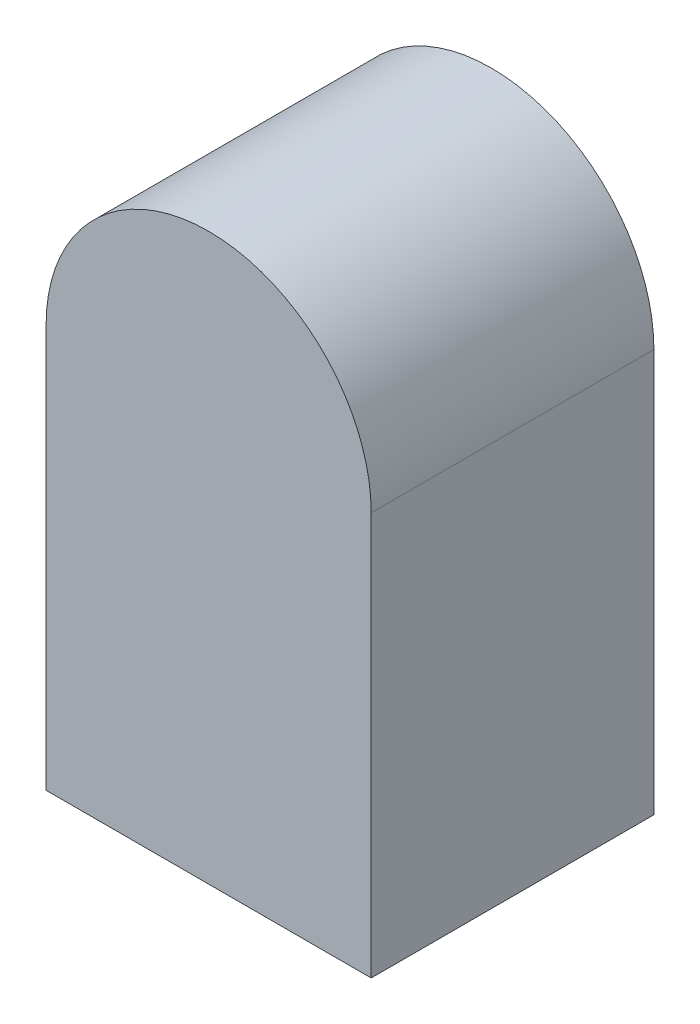
ISO-10303-21;
HEADER;
FILE_DESCRIPTION(('STEP AP214'),'2;1');
FILE_NAME('part.step','',(''),(''),'','','');
FILE_SCHEMA(('AUTOMOTIVE_DESIGN { 1 0 10303 214 1 1 1 1 }'));
ENDSEC;
DATA;
#1=APPLICATION_CONTEXT('core data for automotive mechanical design processes');
#2=APPLICATION_PROTOCOL_DEFINITION('international standard','automotive_design',2000,#1);
#3=PRODUCT_CONTEXT('',#1,'mechanical');
#4=PRODUCT('Part','Part','',(#3));
#5=PRODUCT_RELATED_PRODUCT_CATEGORY('part','',(#4));
#6=PRODUCT_DEFINITION_FORMATION('','',#4);
#7=PRODUCT_DEFINITION_CONTEXT('part definition',#1,'design');
#8=PRODUCT_DEFINITION('design','',#6,#7);
#9=PRODUCT_DEFINITION_SHAPE('','',#8);
#10=(LENGTH_UNIT() NAMED_UNIT(*) SI_UNIT(.MILLI.,.METRE.));
#11=(NAMED_UNIT(*) PLANE_ANGLE_UNIT() SI_UNIT($,.RADIAN.));
#12=(NAMED_UNIT(*) SI_UNIT($,.STERADIAN.) SOLID_ANGLE_UNIT());
#13=UNCERTAINTY_MEASURE_WITH_UNIT(LENGTH_MEASURE(1.E-05),#10,'distance_accuracy_value','');
#14=(GEOMETRIC_REPRESENTATION_CONTEXT(3) GLOBAL_UNCERTAINTY_ASSIGNED_CONTEXT((#13)) GLOBAL_UNIT_ASSIGNED_CONTEXT((#10,
#11,#12)) REPRESENTATION_CONTEXT('',''));
#15=CARTESIAN_POINT('',(0.,0.,0.));
#16=DIRECTION('',(0.,0.,1.));
#17=DIRECTION('',(1.,0.,0.));
#18=AXIS2_PLACEMENT_3D('',#15,#16,#17);
#19=CARTESIAN_POINT('',(-0.25,-2.8335240809167,0.2));
#20=DIRECTION('',(0.,0.,1.));
#21=DIRECTION('',(1.,0.,0.));
#22=AXIS2_PLACEMENT_3D('',#19,#20,#21);
#23=PLANE('',#22);
#24=DIRECTION('',(0.,-1.,0.));
#25=VECTOR('',#24,1.);
#26=CARTESIAN_POINT('',(-0.365,-2.715,0.2));
#27=LINE('',#26,#25);
#28=CARTESIAN_POINT('',(-0.365,-2.715,0.2));
#29=VERTEX_POINT('',#28);
#30=CARTESIAN_POINT('',(-0.365,-3.,0.2));
#31=VERTEX_POINT('',#30);
#32=EDGE_CURVE('E11',#29,#31,#27,.T.);
#33=ORIENTED_EDGE('',*,*,#32,.T.);
#34=DIRECTION('',(1.,0.,0.));
#35=VECTOR('',#34,1.);
#36=CARTESIAN_POINT('',(-1.625,-3.,0.2));
#37=LINE('',#36,#35);
#38=CARTESIAN_POINT('',(-0.135,-3.,0.2));
#39=VERTEX_POINT('',#38);
#40=EDGE_CURVE('E24',#31,#39,#37,.T.);
#41=ORIENTED_EDGE('',*,*,#40,.T.);
#42=DIRECTION('',(0.,1.,0.));
#43=VECTOR('',#42,1.);
#44=CARTESIAN_POINT('',(-0.135,-3.,0.2));
#45=LINE('',#44,#43);
#46=CARTESIAN_POINT('',(-0.135000000000001,-2.715,0.2));
#47=VERTEX_POINT('',#46);
#48=EDGE_CURVE('E88',#39,#47,#45,.T.);
#49=ORIENTED_EDGE('',*,*,#48,.T.);
#50=CARTESIAN_POINT('',(-0.25,-2.715,0.2));
#51=DIRECTION('',(0.,0.,1.));
#52=DIRECTION('',(1.,0.,0.));
#53=AXIS2_PLACEMENT_3D('',#50,#51,#52);
#54=CIRCLE('',#53,0.115);
#55=EDGE_CURVE('E70',#47,#29,#54,.T.);
#56=ORIENTED_EDGE('',*,*,#55,.T.);
#57=EDGE_LOOP('',(#33,#41,#49,#56));
#58=FACE_BOUND('',#57,.T.);
#59=ADVANCED_FACE('F17',(#58),#23,.T.);
#60=CARTESIAN_POINT('',(-3.,-3.,0.));
#61=DIRECTION('',(0.,-1.,0.));
#62=DIRECTION('',(1.,0.,0.));
#63=AXIS2_PLACEMENT_3D('',#60,#61,#62);
#64=PLANE('',#63);
#65=DIRECTION('',(0.,0.,-1.));
#66=VECTOR('',#65,1.);
#67=CARTESIAN_POINT('',(-0.135,-3.,0.));
#68=LINE('',#67,#66);
#69=CARTESIAN_POINT('',(-0.135,-3.,0.));
#70=VERTEX_POINT('',#69);
#71=EDGE_CURVE('E76',#39,#70,#68,.T.);
#72=ORIENTED_EDGE('',*,*,#71,.F.);
#73=ORIENTED_EDGE('',*,*,#40,.F.);
#74=DIRECTION('',(0.,0.,1.));
#75=VECTOR('',#74,1.);
#76=CARTESIAN_POINT('',(-0.365,-3.,0.));
#77=LINE('',#76,#75);
#78=CARTESIAN_POINT('',(-0.365,-3.,0.));
#79=VERTEX_POINT('',#78);
#80=EDGE_CURVE('E84',#79,#31,#77,.T.);
#81=ORIENTED_EDGE('',*,*,#80,.F.);
#82=DIRECTION('',(1.,0.,0.));
#83=VECTOR('',#82,1.);
#84=CARTESIAN_POINT('',(-0.365,-3.,0.));
#85=LINE('',#84,#83);
#86=EDGE_CURVE('E82',#79,#70,#85,.T.);
#87=ORIENTED_EDGE('',*,*,#86,.T.);
#88=EDGE_LOOP('',(#72,#73,#81,#87));
#89=FACE_BOUND('',#88,.T.);
#90=ADVANCED_FACE('F90',(#89),#64,.T.);
#91=CARTESIAN_POINT('',(-0.365,-2.715,0.));
#92=DIRECTION('',(-1.,0.,0.));
#93=DIRECTION('',(0.,-1.,0.));
#94=AXIS2_PLACEMENT_3D('',#91,#92,#93);
#95=PLANE('',#94);
#96=DIRECTION('',(0.,-1.,0.));
#97=VECTOR('',#96,1.);
#98=CARTESIAN_POINT('',(-0.365,-2.715,0.));
#99=LINE('',#98,#97);
#100=CARTESIAN_POINT('',(-0.365,-2.715,0.));
#101=VERTEX_POINT('',#100);
#102=EDGE_CURVE('E61',#101,#79,#99,.T.);
#103=ORIENTED_EDGE('',*,*,#102,.T.);
#104=ORIENTED_EDGE('',*,*,#80,.T.);
#105=ORIENTED_EDGE('',*,*,#32,.F.);
#106=DIRECTION('',(0.,0.,1.));
#107=VECTOR('',#106,1.);
#108=CARTESIAN_POINT('',(-0.365,-2.715,0.));
#109=LINE('',#108,#107);
#110=EDGE_CURVE('E64',#101,#29,#109,.T.);
#111=ORIENTED_EDGE('',*,*,#110,.F.);
#112=EDGE_LOOP('',(#103,#104,#105,#111));
#113=FACE_BOUND('',#112,.T.);
#114=ADVANCED_FACE('F91',(#113),#95,.T.);
#115=CARTESIAN_POINT('',(-0.25,-2.715,0.));
#116=DIRECTION('',(0.,0.,1.));
#117=DIRECTION('',(1.,0.,0.));
#118=AXIS2_PLACEMENT_3D('',#115,#116,#117);
#119=CYLINDRICAL_SURFACE('',#118,0.115);
#120=CARTESIAN_POINT('',(-0.25,-2.715,0.));
#121=DIRECTION('',(0.,0.,1.));
#122=DIRECTION('',(1.,0.,0.));
#123=AXIS2_PLACEMENT_3D('',#120,#121,#122);
#124=CIRCLE('',#123,0.115);
#125=CARTESIAN_POINT('',(-0.135000000000001,-2.715,0.));
#126=VERTEX_POINT('',#125);
#127=EDGE_CURVE('E54',#126,#101,#124,.T.);
#128=ORIENTED_EDGE('',*,*,#127,.T.);
#129=ORIENTED_EDGE('',*,*,#110,.T.);
#130=ORIENTED_EDGE('',*,*,#55,.F.);
#131=DIRECTION('',(0.,0.,1.));
#132=VECTOR('',#131,1.);
#133=CARTESIAN_POINT('',(-0.135000000000001,-2.715,0.));
#134=LINE('',#133,#132);
#135=EDGE_CURVE('E65',#126,#47,#134,.T.);
#136=ORIENTED_EDGE('',*,*,#135,.F.);
#137=EDGE_LOOP('',(#128,#129,#130,#136));
#138=FACE_BOUND('',#137,.T.);
#139=ADVANCED_FACE('F69',(#138),#119,.T.);
#140=CARTESIAN_POINT('',(-0.135,-3.,0.));
#141=DIRECTION('',(1.,0.,0.));
#142=DIRECTION('',(0.,1.,0.));
#143=AXIS2_PLACEMENT_3D('',#140,#141,#142);
#144=PLANE('',#143);
#145=DIRECTION('',(0.,1.,0.));
#146=VECTOR('',#145,1.);
#147=CARTESIAN_POINT('',(-0.135,-3.,0.));
#148=LINE('',#147,#146);
#149=EDGE_CURVE('E59',#70,#126,#148,.T.);
#150=ORIENTED_EDGE('',*,*,#149,.T.);
#151=ORIENTED_EDGE('',*,*,#135,.T.);
#152=ORIENTED_EDGE('',*,*,#48,.F.);
#153=ORIENTED_EDGE('',*,*,#71,.T.);
#154=EDGE_LOOP('',(#150,#151,#152,#153));
#155=FACE_BOUND('',#154,.T.);
#156=ADVANCED_FACE('F74',(#155),#144,.T.);
#157=CARTESIAN_POINT('',(-0.25,-2.8335265642716,0.));
#158=DIRECTION('',(0.,0.,1.));
#159=DIRECTION('',(0.,1.,0.));
#160=AXIS2_PLACEMENT_3D('',#157,#158,#159);
#161=PLANE('',#160);
#162=ORIENTED_EDGE('',*,*,#86,.F.);
#163=ORIENTED_EDGE('',*,*,#102,.F.);
#164=ORIENTED_EDGE('',*,*,#127,.F.);
#165=ORIENTED_EDGE('',*,*,#149,.F.);
#166=EDGE_LOOP('',(#162,#163,#164,#165));
#167=FACE_BOUND('',#166,.T.);
#168=ADVANCED_FACE('F57',(#167),#161,.F.);
#169=CLOSED_SHELL('',(#59,#90,#114,#139,#156,#168));
#170=MANIFOLD_SOLID_BREP('B1',#169);
#171=ADVANCED_BREP_SHAPE_REPRESENTATION('',(#18,#170),#14);
#172=SHAPE_DEFINITION_REPRESENTATION(#9,#171);
ENDSEC;
END-ISO-10303-21;
